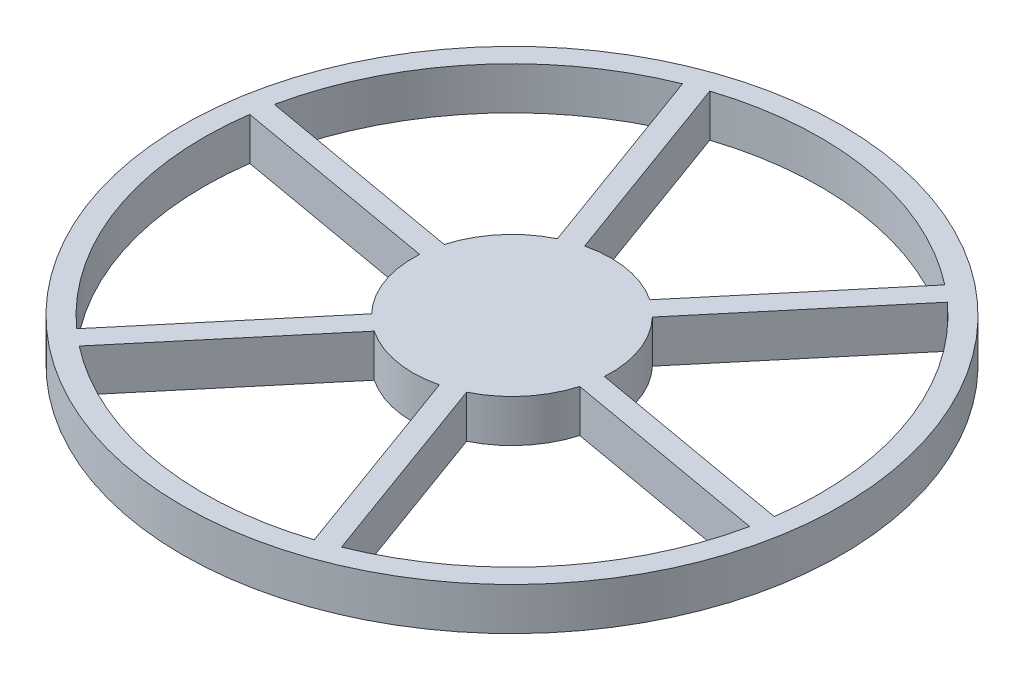
ISO-10303-21;
HEADER;
FILE_DESCRIPTION(('STEP AP214'),'2;1');
FILE_NAME('part.step','',(''),(''),'','','');
FILE_SCHEMA(('AUTOMOTIVE_DESIGN { 1 0 10303 214 1 1 1 1 }'));
ENDSEC;
DATA;
#1=APPLICATION_CONTEXT('core data for automotive mechanical design processes');
#2=APPLICATION_PROTOCOL_DEFINITION('international standard','automotive_design',2000,#1);
#3=PRODUCT_CONTEXT('',#1,'mechanical');
#4=PRODUCT('Part','Part','',(#3));
#5=PRODUCT_RELATED_PRODUCT_CATEGORY('part','',(#4));
#6=PRODUCT_DEFINITION_FORMATION('','',#4);
#7=PRODUCT_DEFINITION_CONTEXT('part definition',#1,'design');
#8=PRODUCT_DEFINITION('design','',#6,#7);
#9=PRODUCT_DEFINITION_SHAPE('','',#8);
#10=(LENGTH_UNIT() NAMED_UNIT(*) SI_UNIT(.MILLI.,.METRE.));
#11=(NAMED_UNIT(*) PLANE_ANGLE_UNIT() SI_UNIT($,.RADIAN.));
#12=(NAMED_UNIT(*) SI_UNIT($,.STERADIAN.) SOLID_ANGLE_UNIT());
#13=UNCERTAINTY_MEASURE_WITH_UNIT(LENGTH_MEASURE(1.E-05),#10,'distance_accuracy_value','');
#14=(GEOMETRIC_REPRESENTATION_CONTEXT(3) GLOBAL_UNCERTAINTY_ASSIGNED_CONTEXT((#13)) GLOBAL_UNIT_ASSIGNED_CONTEXT((#10,
#11,#12)) REPRESENTATION_CONTEXT('',''));
#15=CARTESIAN_POINT('',(0.,0.,0.));
#16=DIRECTION('',(0.,0.,1.));
#17=DIRECTION('',(1.,0.,0.));
#18=AXIS2_PLACEMENT_3D('',#15,#16,#17);
#19=CARTESIAN_POINT('',(0.,12.7,0.));
#20=DIRECTION('',(0.,-1.,0.));
#21=DIRECTION('',(0.,0.,-1.));
#22=AXIS2_PLACEMENT_3D('',#19,#20,#21);
#23=CYLINDRICAL_SURFACE('',#22,98.425);
#24=CARTESIAN_POINT('',(0.,12.7,0.));
#25=DIRECTION('',(0.,1.,0.));
#26=DIRECTION('',(0.,0.,1.));
#27=AXIS2_PLACEMENT_3D('',#24,#25,#26);
#28=CIRCLE('',#27,98.425);
#29=CARTESIAN_POINT('',(0.,12.7,98.425));
#30=VERTEX_POINT('',#29);
#31=EDGE_CURVE('E11',#30,#30,#28,.T.);
#32=ORIENTED_EDGE('',*,*,#31,.F.);
#33=EDGE_LOOP('',(#32));
#34=FACE_BOUND('',#33,.T.);
#35=CARTESIAN_POINT('',(0.,0.,0.));
#36=DIRECTION('',(0.,1.,0.));
#37=DIRECTION('',(0.,0.,1.));
#38=AXIS2_PLACEMENT_3D('',#35,#36,#37);
#39=CIRCLE('',#38,98.425);
#40=CARTESIAN_POINT('',(0.,0.,98.425));
#41=VERTEX_POINT('',#40);
#42=EDGE_CURVE('E36',#41,#41,#39,.T.);
#43=ORIENTED_EDGE('',*,*,#42,.T.);
#44=EDGE_LOOP('',(#43));
#45=FACE_BOUND('',#44,.T.);
#46=ADVANCED_FACE('F33',(#34,#45),#23,.T.);
#47=CARTESIAN_POINT('',(0.,12.7,0.));
#48=DIRECTION('',(0.,1.,0.));
#49=DIRECTION('',(0.,0.,1.));
#50=AXIS2_PLACEMENT_3D('',#47,#48,#49);
#51=PLANE('',#50);
#52=CARTESIAN_POINT('',(0.,12.7,0.));
#53=DIRECTION('',(0.,1.,0.));
#54=DIRECTION('',(0.,0.,1.));
#55=AXIS2_PLACEMENT_3D('',#52,#53,#54);
#56=CIRCLE('',#55,92.075);
#57=CARTESIAN_POINT('',(-34.4563005444042,12.7,-85.3848287331754));
#58=VERTEX_POINT('',#57);
#59=CARTESIAN_POINT('',(-90.0709151247292,12.7,-19.1059120063355));
#60=VERTEX_POINT('',#59);
#61=EDGE_CURVE('E47',#58,#60,#56,.T.);
#62=ORIENTED_EDGE('',*,*,#61,.F.);
#63=DIRECTION('',(-0.342020143325668,0.,-0.939692620785909));
#64=VECTOR('',#63,1.);
#65=CARTESIAN_POINT('',(-13.0671740658742,12.7,-26.6186867115551));
#66=LINE('',#65,#64);
#67=CARTESIAN_POINT('',(-13.0671740658742,12.7,-26.6186867115551));
#68=VERTEX_POINT('',#67);
#69=EDGE_CURVE('E211',#68,#58,#66,.T.);
#70=ORIENTED_EDGE('',*,*,#69,.F.);
#71=CARTESIAN_POINT('',(0.,12.7,0.));
#72=DIRECTION('',(0.,-1.,0.));
#73=DIRECTION('',(0.,0.,1.));
#74=AXIS2_PLACEMENT_3D('',#71,#72,#73);
#75=CIRCLE('',#74,29.6530861853497);
#76=CARTESIAN_POINT('',(-28.4833800123381,12.7,-8.24636789068482));
#77=VERTEX_POINT('',#76);
#78=EDGE_CURVE('E214',#77,#68,#75,.T.);
#79=ORIENTED_EDGE('',*,*,#78,.F.);
#80=DIRECTION('',(0.984807753012191,0.,0.173648177667026));
#81=VECTOR('',#80,1.);
#82=CARTESIAN_POINT('',(-28.4833800123381,12.7,-8.24636789068482));
#83=LINE('',#82,#81);
#84=EDGE_CURVE('E220',#60,#77,#83,.T.);
#85=ORIENTED_EDGE('',*,*,#84,.F.);
#86=EDGE_LOOP('',(#62,#70,#79,#85));
#87=FACE_BOUND('',#86,.T.);
#88=CARTESIAN_POINT('',(0.,12.7,0.));
#89=DIRECTION('',(0.,1.,0.));
#90=DIRECTION('',(0.,0.,1.));
#91=AXIS2_PLACEMENT_3D('',#88,#89,#90);
#92=CIRCLE('',#91,92.0749999999998);
#93=CARTESIAN_POINT('',(-91.1735810529151,12.7,-12.852382774702));
#94=VERTEX_POINT('',#93);
#95=CARTESIAN_POINT('',(-61.5816627223215,12.7,68.4507446369595));
#96=VERTEX_POINT('',#95);
#97=EDGE_CURVE('E226',#94,#96,#92,.T.);
#98=ORIENTED_EDGE('',*,*,#97,.F.);
#99=DIRECTION('',(-0.984807753012208,0.,-0.173648177666931));
#100=VECTOR('',#99,1.);
#101=CARTESIAN_POINT('',(-29.5860459405231,12.7,-1.99283865905731));
#102=LINE('',#101,#100);
#103=CARTESIAN_POINT('',(-29.5860459405231,12.7,-1.99283865905733));
#104=VERTEX_POINT('',#103);
#105=EDGE_CURVE('E234',#104,#94,#102,.T.);
#106=ORIENTED_EDGE('',*,*,#105,.F.);
#107=CARTESIAN_POINT('',(0.,12.7,0.));
#108=DIRECTION('',(0.,-1.,0.));
#109=DIRECTION('',(0.,0.,1.));
#110=AXIS2_PLACEMENT_3D('',#107,#108,#109);
#111=CIRCLE('',#110,29.6530861853497);
#112=CARTESIAN_POINT('',(-21.3832540884544,12.7,20.5441467309883));
#113=VERTEX_POINT('',#112);
#114=EDGE_CURVE('E248',#113,#104,#111,.T.);
#115=ORIENTED_EDGE('',*,*,#114,.F.);
#116=DIRECTION('',(0.642787609686618,0.,-0.766044443118913));
#117=VECTOR('',#116,1.);
#118=CARTESIAN_POINT('',(-21.3832540884544,12.7,20.5441467309883));
#119=LINE('',#118,#117);
#120=EDGE_CURVE('E245',#96,#113,#119,.T.);
#121=ORIENTED_EDGE('',*,*,#120,.F.);
#122=EDGE_LOOP('',(#98,#106,#115,#121));
#123=FACE_BOUND('',#122,.T.);
#124=CARTESIAN_POINT('',(0.,12.7,0.));
#125=DIRECTION('',(0.,1.,0.));
#126=DIRECTION('',(0.,0.,1.));
#127=AXIS2_PLACEMENT_3D('',#124,#125,#126);
#128=CIRCLE('',#127,92.0749999999998);
#129=CARTESIAN_POINT('',(-56.717280508511,12.7,72.532445958473));
#130=VERTEX_POINT('',#129);
#131=CARTESIAN_POINT('',(28.4892524024083,12.7,87.5566566432951));
#132=VERTEX_POINT('',#131);
#133=EDGE_CURVE('E255',#130,#132,#128,.T.);
#134=ORIENTED_EDGE('',*,*,#133,.F.);
#135=DIRECTION('',(-0.642787609686541,0.,0.766044443118977));
#136=VECTOR('',#135,1.);
#137=CARTESIAN_POINT('',(-16.5188718746489,12.7,24.6258480524978));
#138=LINE('',#137,#136);
#139=CARTESIAN_POINT('',(-16.5188718746489,12.7,24.6258480524978));
#140=VERTEX_POINT('',#139);
#141=EDGE_CURVE('E266',#140,#130,#138,.T.);
#142=ORIENTED_EDGE('',*,*,#141,.F.);
#143=CARTESIAN_POINT('',(0.,12.7,0.));
#144=DIRECTION('',(0.,-1.,0.));
#145=DIRECTION('',(0.,0.,1.));
#146=AXIS2_PLACEMENT_3D('',#143,#144,#145);
#147=CIRCLE('',#146,29.6530861853497);
#148=CARTESIAN_POINT('',(7.10012592388372,12.7,28.7905146216731));
#149=VERTEX_POINT('',#148);
#150=EDGE_CURVE('E280',#149,#140,#147,.T.);
#151=ORIENTED_EDGE('',*,*,#150,.F.);
#152=DIRECTION('',(-0.342020143325583,0.,-0.93969262078594));
#153=VECTOR('',#152,1.);
#154=CARTESIAN_POINT('',(7.10012592388372,12.7,28.7905146216731));
#155=LINE('',#154,#153);
#156=EDGE_CURVE('E277',#132,#149,#155,.T.);
#157=ORIENTED_EDGE('',*,*,#156,.F.);
#158=EDGE_LOOP('',(#134,#142,#151,#157));
#159=FACE_BOUND('',#158,.T.);
#160=CARTESIAN_POINT('',(0.,12.7,0.));
#161=DIRECTION('',(0.,1.,0.));
#162=DIRECTION('',(0.,0.,1.));
#163=AXIS2_PLACEMENT_3D('',#160,#161,#162);
#164=CIRCLE('',#163,92.0749999999998);
#165=CARTESIAN_POINT('',(34.456300544404,12.7,85.384828733175));
#166=VERTEX_POINT('',#165);
#167=CARTESIAN_POINT('',(90.0709151247292,12.7,19.1059120063356));
#168=VERTEX_POINT('',#167);
#169=EDGE_CURVE('E287',#166,#168,#164,.T.);
#170=ORIENTED_EDGE('',*,*,#169,.F.);
#171=DIRECTION('',(0.342020143325667,0.,0.939692620785909));
#172=VECTOR('',#171,1.);
#173=CARTESIAN_POINT('',(13.0671740658743,12.7,26.6186867115551));
#174=LINE('',#173,#172);
#175=CARTESIAN_POINT('',(13.0671740658743,12.7,26.6186867115551));
#176=VERTEX_POINT('',#175);
#177=EDGE_CURVE('E298',#176,#166,#174,.T.);
#178=ORIENTED_EDGE('',*,*,#177,.F.);
#179=CARTESIAN_POINT('',(0.,12.7,0.));
#180=DIRECTION('',(0.,-1.,0.));
#181=DIRECTION('',(0.,0.,1.));
#182=AXIS2_PLACEMENT_3D('',#179,#180,#181);
#183=CIRCLE('',#182,29.6530861853497);
#184=CARTESIAN_POINT('',(28.4833800123381,12.7,8.2463678906847));
#185=VERTEX_POINT('',#184);
#186=EDGE_CURVE('E312',#185,#176,#183,.T.);
#187=ORIENTED_EDGE('',*,*,#186,.F.);
#188=DIRECTION('',(-0.984807753012191,0.,-0.173648177667029));
#189=VECTOR('',#188,1.);
#190=CARTESIAN_POINT('',(28.4833800123381,12.7,8.2463678906847));
#191=LINE('',#190,#189);
#192=EDGE_CURVE('E309',#168,#185,#191,.T.);
#193=ORIENTED_EDGE('',*,*,#192,.F.);
#194=EDGE_LOOP('',(#170,#178,#187,#193));
#195=FACE_BOUND('',#194,.T.);
#196=CARTESIAN_POINT('',(0.,12.7,0.));
#197=DIRECTION('',(0.,1.,0.));
#198=DIRECTION('',(0.,0.,1.));
#199=AXIS2_PLACEMENT_3D('',#196,#197,#198);
#200=CIRCLE('',#199,92.075);
#201=CARTESIAN_POINT('',(56.7172805085112,12.7,-72.5324459584734));
#202=VERTEX_POINT('',#201);
#203=CARTESIAN_POINT('',(-28.4892524023576,12.7,-87.5566566433117));
#204=VERTEX_POINT('',#203);
#205=EDGE_CURVE('E319',#202,#204,#200,.T.);
#206=ORIENTED_EDGE('',*,*,#205,.F.);
#207=DIRECTION('',(0.64278760968654,0.,-0.766044443118977));
#208=VECTOR('',#207,1.);
#209=CARTESIAN_POINT('',(16.5188718746488,12.7,-24.6258480524979));
#210=LINE('',#209,#208);
#211=CARTESIAN_POINT('',(16.5188718746488,12.7,-24.6258480524979));
#212=VERTEX_POINT('',#211);
#213=EDGE_CURVE('E330',#212,#202,#210,.T.);
#214=ORIENTED_EDGE('',*,*,#213,.F.);
#215=CARTESIAN_POINT('',(0.,12.7,0.));
#216=DIRECTION('',(0.,-1.,0.));
#217=DIRECTION('',(0.,0.,1.));
#218=AXIS2_PLACEMENT_3D('',#215,#216,#217);
#219=CIRCLE('',#218,29.6530861853497);
#220=CARTESIAN_POINT('',(-7.10012592386938,12.7,-28.7905146216766));
#221=VERTEX_POINT('',#220);
#222=EDGE_CURVE('E344',#221,#212,#219,.T.);
#223=ORIENTED_EDGE('',*,*,#222,.F.);
#224=DIRECTION('',(0.342020143325002,0.,0.939692620786151));
#225=VECTOR('',#224,1.);
#226=CARTESIAN_POINT('',(-7.10012592386939,12.7,-28.7905146216766));
#227=LINE('',#226,#225);
#228=EDGE_CURVE('E341',#204,#221,#227,.T.);
#229=ORIENTED_EDGE('',*,*,#228,.F.);
#230=EDGE_LOOP('',(#206,#214,#223,#229));
#231=FACE_BOUND('',#230,.T.);
#232=CARTESIAN_POINT('',(0.,12.7,0.));
#233=DIRECTION('',(0.,1.,0.));
#234=DIRECTION('',(0.,0.,1.));
#235=AXIS2_PLACEMENT_3D('',#232,#233,#234);
#236=CIRCLE('',#235,92.0749999999998);
#237=CARTESIAN_POINT('',(91.1735810529151,12.7,12.8523827747019));
#238=VERTEX_POINT('',#237);
#239=CARTESIAN_POINT('',(61.5816627223167,12.7,-68.4507446369638));
#240=VERTEX_POINT('',#239);
#241=EDGE_CURVE('E351',#238,#240,#236,.T.);
#242=ORIENTED_EDGE('',*,*,#241,.F.);
#243=DIRECTION('',(0.984807753012208,0.,0.173648177666931));
#244=VECTOR('',#243,1.);
#245=CARTESIAN_POINT('',(29.5860459405231,12.7,1.99283865905718));
#246=LINE('',#245,#244);
#247=CARTESIAN_POINT('',(29.5860459405231,12.7,1.99283865905719));
#248=VERTEX_POINT('',#247);
#249=EDGE_CURVE('E362',#248,#238,#246,.T.);
#250=ORIENTED_EDGE('',*,*,#249,.F.);
#251=CARTESIAN_POINT('',(0.,12.7,0.));
#252=DIRECTION('',(0.,-1.,0.));
#253=DIRECTION('',(0.,0.,1.));
#254=AXIS2_PLACEMENT_3D('',#251,#252,#253);
#255=CIRCLE('',#254,29.6530861853497);
#256=CARTESIAN_POINT('',(21.3832540884543,12.7,-20.5441467309884));
#257=VERTEX_POINT('',#256);
#258=EDGE_CURVE('E376',#257,#248,#255,.T.);
#259=ORIENTED_EDGE('',*,*,#258,.F.);
#260=DIRECTION('',(-0.64278760968654,0.,0.766044443118977));
#261=VECTOR('',#260,1.);
#262=CARTESIAN_POINT('',(21.3832540884543,12.7,-20.5441467309884));
#263=LINE('',#262,#261);
#264=EDGE_CURVE('E373',#240,#257,#263,.T.);
#265=ORIENTED_EDGE('',*,*,#264,.F.);
#266=EDGE_LOOP('',(#242,#250,#259,#265));
#267=FACE_BOUND('',#266,.T.);
#268=ORIENTED_EDGE('',*,*,#31,.T.);
#269=EDGE_LOOP('',(#268));
#270=FACE_BOUND('',#269,.T.);
#271=ADVANCED_FACE('F398',(#87,#123,#159,#195,#231,#267,#270),#51,.T.);
#272=CARTESIAN_POINT('',(0.,0.,0.));
#273=DIRECTION('',(0.,1.,0.));
#274=DIRECTION('',(0.,0.,1.));
#275=AXIS2_PLACEMENT_3D('',#272,#273,#274);
#276=PLANE('',#275);
#277=DIRECTION('',(-0.342020143325668,0.,-0.939692620785909));
#278=VECTOR('',#277,1.);
#279=CARTESIAN_POINT('',(-13.0671740658742,0.,-26.6186867115551));
#280=LINE('',#279,#278);
#281=CARTESIAN_POINT('',(-13.0671740658742,0.,-26.6186867115551));
#282=VERTEX_POINT('',#281);
#283=CARTESIAN_POINT('',(-34.4563005444042,0.,-85.3848287331754));
#284=VERTEX_POINT('',#283);
#285=EDGE_CURVE('E201',#282,#284,#280,.T.);
#286=ORIENTED_EDGE('',*,*,#285,.T.);
#287=CARTESIAN_POINT('',(0.,0.,0.));
#288=DIRECTION('',(0.,1.,0.));
#289=DIRECTION('',(0.,0.,1.));
#290=AXIS2_PLACEMENT_3D('',#287,#288,#289);
#291=CIRCLE('',#290,92.075);
#292=CARTESIAN_POINT('',(-90.0709151247292,0.,-19.1059120063355));
#293=VERTEX_POINT('',#292);
#294=EDGE_CURVE('E195',#284,#293,#291,.T.);
#295=ORIENTED_EDGE('',*,*,#294,.T.);
#296=DIRECTION('',(0.984807753012191,0.,0.173648177667026));
#297=VECTOR('',#296,1.);
#298=CARTESIAN_POINT('',(-28.4833800123381,0.,-8.24636789068482));
#299=LINE('',#298,#297);
#300=CARTESIAN_POINT('',(-28.4833800123381,0.,-8.24636789068482));
#301=VERTEX_POINT('',#300);
#302=EDGE_CURVE('E204',#293,#301,#299,.T.);
#303=ORIENTED_EDGE('',*,*,#302,.T.);
#304=CARTESIAN_POINT('',(0.,0.,0.));
#305=DIRECTION('',(0.,-1.,0.));
#306=DIRECTION('',(0.,0.,1.));
#307=AXIS2_PLACEMENT_3D('',#304,#305,#306);
#308=CIRCLE('',#307,29.6530861853497);
#309=EDGE_CURVE('E55',#301,#282,#308,.T.);
#310=ORIENTED_EDGE('',*,*,#309,.T.);
#311=EDGE_LOOP('',(#286,#295,#303,#310));
#312=FACE_BOUND('',#311,.T.);
#313=DIRECTION('',(-0.984807753012208,0.,-0.173648177666931));
#314=VECTOR('',#313,1.);
#315=CARTESIAN_POINT('',(-29.5860459405231,0.,-1.99283865905731));
#316=LINE('',#315,#314);
#317=CARTESIAN_POINT('',(-29.5860459405231,0.,-1.99283865905733));
#318=VERTEX_POINT('',#317);
#319=CARTESIAN_POINT('',(-91.1735810529151,0.,-12.852382774702));
#320=VERTEX_POINT('',#319);
#321=EDGE_CURVE('E240',#318,#320,#316,.T.);
#322=ORIENTED_EDGE('',*,*,#321,.T.);
#323=CARTESIAN_POINT('',(0.,0.,0.));
#324=DIRECTION('',(0.,1.,0.));
#325=DIRECTION('',(0.,0.,1.));
#326=AXIS2_PLACEMENT_3D('',#323,#324,#325);
#327=CIRCLE('',#326,92.0749999999998);
#328=CARTESIAN_POINT('',(-61.5816627223215,0.,68.4507446369595));
#329=VERTEX_POINT('',#328);
#330=EDGE_CURVE('E230',#320,#329,#327,.T.);
#331=ORIENTED_EDGE('',*,*,#330,.T.);
#332=DIRECTION('',(0.642787609686618,0.,-0.766044443118913));
#333=VECTOR('',#332,1.);
#334=CARTESIAN_POINT('',(-21.3832540884544,0.,20.5441467309883));
#335=LINE('',#334,#333);
#336=CARTESIAN_POINT('',(-21.3832540884544,0.,20.5441467309883));
#337=VERTEX_POINT('',#336);
#338=EDGE_CURVE('E233',#329,#337,#335,.T.);
#339=ORIENTED_EDGE('',*,*,#338,.T.);
#340=CARTESIAN_POINT('',(0.,0.,0.));
#341=DIRECTION('',(0.,-1.,0.));
#342=DIRECTION('',(0.,0.,1.));
#343=AXIS2_PLACEMENT_3D('',#340,#341,#342);
#344=CIRCLE('',#343,29.6530861853497);
#345=EDGE_CURVE('E237',#337,#318,#344,.T.);
#346=ORIENTED_EDGE('',*,*,#345,.T.);
#347=EDGE_LOOP('',(#322,#331,#339,#346));
#348=FACE_BOUND('',#347,.T.);
#349=DIRECTION('',(-0.642787609686541,0.,0.766044443118977));
#350=VECTOR('',#349,1.);
#351=CARTESIAN_POINT('',(-16.5188718746489,0.,24.6258480524978));
#352=LINE('',#351,#350);
#353=CARTESIAN_POINT('',(-16.5188718746489,0.,24.6258480524978));
#354=VERTEX_POINT('',#353);
#355=CARTESIAN_POINT('',(-56.717280508511,0.,72.532445958473));
#356=VERTEX_POINT('',#355);
#357=EDGE_CURVE('E272',#354,#356,#352,.T.);
#358=ORIENTED_EDGE('',*,*,#357,.T.);
#359=CARTESIAN_POINT('',(0.,0.,0.));
#360=DIRECTION('',(0.,1.,0.));
#361=DIRECTION('',(0.,0.,1.));
#362=AXIS2_PLACEMENT_3D('',#359,#360,#361);
#363=CIRCLE('',#362,92.0749999999998);
#364=CARTESIAN_POINT('',(28.4892524024083,0.,87.5566566432951));
#365=VERTEX_POINT('',#364);
#366=EDGE_CURVE('E262',#356,#365,#363,.T.);
#367=ORIENTED_EDGE('',*,*,#366,.T.);
#368=DIRECTION('',(-0.342020143325583,0.,-0.93969262078594));
#369=VECTOR('',#368,1.);
#370=CARTESIAN_POINT('',(7.10012592388372,0.,28.7905146216731));
#371=LINE('',#370,#369);
#372=CARTESIAN_POINT('',(7.10012592388372,0.,28.7905146216731));
#373=VERTEX_POINT('',#372);
#374=EDGE_CURVE('E265',#365,#373,#371,.T.);
#375=ORIENTED_EDGE('',*,*,#374,.T.);
#376=CARTESIAN_POINT('',(0.,0.,0.));
#377=DIRECTION('',(0.,-1.,0.));
#378=DIRECTION('',(0.,0.,1.));
#379=AXIS2_PLACEMENT_3D('',#376,#377,#378);
#380=CIRCLE('',#379,29.6530861853497);
#381=EDGE_CURVE('E269',#373,#354,#380,.T.);
#382=ORIENTED_EDGE('',*,*,#381,.T.);
#383=EDGE_LOOP('',(#358,#367,#375,#382));
#384=FACE_BOUND('',#383,.T.);
#385=DIRECTION('',(0.342020143325667,0.,0.939692620785909));
#386=VECTOR('',#385,1.);
#387=CARTESIAN_POINT('',(13.0671740658743,0.,26.6186867115551));
#388=LINE('',#387,#386);
#389=CARTESIAN_POINT('',(13.0671740658743,0.,26.6186867115551));
#390=VERTEX_POINT('',#389);
#391=CARTESIAN_POINT('',(34.456300544404,0.,85.384828733175));
#392=VERTEX_POINT('',#391);
#393=EDGE_CURVE('E304',#390,#392,#388,.T.);
#394=ORIENTED_EDGE('',*,*,#393,.T.);
#395=CARTESIAN_POINT('',(0.,0.,0.));
#396=DIRECTION('',(0.,1.,0.));
#397=DIRECTION('',(0.,0.,1.));
#398=AXIS2_PLACEMENT_3D('',#395,#396,#397);
#399=CIRCLE('',#398,92.0749999999998);
#400=CARTESIAN_POINT('',(90.0709151247292,0.,19.1059120063356));
#401=VERTEX_POINT('',#400);
#402=EDGE_CURVE('E294',#392,#401,#399,.T.);
#403=ORIENTED_EDGE('',*,*,#402,.T.);
#404=DIRECTION('',(-0.984807753012191,0.,-0.173648177667029));
#405=VECTOR('',#404,1.);
#406=CARTESIAN_POINT('',(28.4833800123381,0.,8.2463678906847));
#407=LINE('',#406,#405);
#408=CARTESIAN_POINT('',(28.4833800123381,0.,8.2463678906847));
#409=VERTEX_POINT('',#408);
#410=EDGE_CURVE('E297',#401,#409,#407,.T.);
#411=ORIENTED_EDGE('',*,*,#410,.T.);
#412=CARTESIAN_POINT('',(0.,0.,0.));
#413=DIRECTION('',(0.,-1.,0.));
#414=DIRECTION('',(0.,0.,1.));
#415=AXIS2_PLACEMENT_3D('',#412,#413,#414);
#416=CIRCLE('',#415,29.6530861853497);
#417=EDGE_CURVE('E301',#409,#390,#416,.T.);
#418=ORIENTED_EDGE('',*,*,#417,.T.);
#419=EDGE_LOOP('',(#394,#403,#411,#418));
#420=FACE_BOUND('',#419,.T.);
#421=DIRECTION('',(0.64278760968654,0.,-0.766044443118977));
#422=VECTOR('',#421,1.);
#423=CARTESIAN_POINT('',(16.5188718746488,0.,-24.6258480524979));
#424=LINE('',#423,#422);
#425=CARTESIAN_POINT('',(16.5188718746488,0.,-24.6258480524979));
#426=VERTEX_POINT('',#425);
#427=CARTESIAN_POINT('',(56.7172805085112,0.,-72.5324459584734));
#428=VERTEX_POINT('',#427);
#429=EDGE_CURVE('E336',#426,#428,#424,.T.);
#430=ORIENTED_EDGE('',*,*,#429,.T.);
#431=CARTESIAN_POINT('',(0.,0.,0.));
#432=DIRECTION('',(0.,1.,0.));
#433=DIRECTION('',(0.,0.,1.));
#434=AXIS2_PLACEMENT_3D('',#431,#432,#433);
#435=CIRCLE('',#434,92.075);
#436=CARTESIAN_POINT('',(-28.4892524023576,0.,-87.5566566433117));
#437=VERTEX_POINT('',#436);
#438=EDGE_CURVE('E326',#428,#437,#435,.T.);
#439=ORIENTED_EDGE('',*,*,#438,.T.);
#440=DIRECTION('',(0.342020143325002,0.,0.939692620786151));
#441=VECTOR('',#440,1.);
#442=CARTESIAN_POINT('',(-7.10012592386939,0.,-28.7905146216766));
#443=LINE('',#442,#441);
#444=CARTESIAN_POINT('',(-7.10012592386939,0.,-28.7905146216766));
#445=VERTEX_POINT('',#444);
#446=EDGE_CURVE('E329',#437,#445,#443,.T.);
#447=ORIENTED_EDGE('',*,*,#446,.T.);
#448=CARTESIAN_POINT('',(0.,0.,0.));
#449=DIRECTION('',(0.,-1.,0.));
#450=DIRECTION('',(0.,0.,1.));
#451=AXIS2_PLACEMENT_3D('',#448,#449,#450);
#452=CIRCLE('',#451,29.6530861853497);
#453=EDGE_CURVE('E333',#445,#426,#452,.T.);
#454=ORIENTED_EDGE('',*,*,#453,.T.);
#455=EDGE_LOOP('',(#430,#439,#447,#454));
#456=FACE_BOUND('',#455,.T.);
#457=DIRECTION('',(0.984807753012208,0.,0.173648177666931));
#458=VECTOR('',#457,1.);
#459=CARTESIAN_POINT('',(29.5860459405231,0.,1.99283865905718));
#460=LINE('',#459,#458);
#461=CARTESIAN_POINT('',(29.5860459405231,0.,1.99283865905719));
#462=VERTEX_POINT('',#461);
#463=CARTESIAN_POINT('',(91.1735810529151,0.,12.8523827747019));
#464=VERTEX_POINT('',#463);
#465=EDGE_CURVE('E368',#462,#464,#460,.T.);
#466=ORIENTED_EDGE('',*,*,#465,.T.);
#467=CARTESIAN_POINT('',(0.,0.,0.));
#468=DIRECTION('',(0.,1.,0.));
#469=DIRECTION('',(0.,0.,1.));
#470=AXIS2_PLACEMENT_3D('',#467,#468,#469);
#471=CIRCLE('',#470,92.0749999999998);
#472=CARTESIAN_POINT('',(61.5816627223167,0.,-68.4507446369638));
#473=VERTEX_POINT('',#472);
#474=EDGE_CURVE('E358',#464,#473,#471,.T.);
#475=ORIENTED_EDGE('',*,*,#474,.T.);
#476=DIRECTION('',(-0.64278760968654,0.,0.766044443118977));
#477=VECTOR('',#476,1.);
#478=CARTESIAN_POINT('',(21.3832540884543,0.,-20.5441467309884));
#479=LINE('',#478,#477);
#480=CARTESIAN_POINT('',(21.3832540884543,0.,-20.5441467309884));
#481=VERTEX_POINT('',#480);
#482=EDGE_CURVE('E361',#473,#481,#479,.T.);
#483=ORIENTED_EDGE('',*,*,#482,.T.);
#484=CARTESIAN_POINT('',(0.,0.,0.));
#485=DIRECTION('',(0.,-1.,0.));
#486=DIRECTION('',(0.,0.,1.));
#487=AXIS2_PLACEMENT_3D('',#484,#485,#486);
#488=CIRCLE('',#487,29.6530861853497);
#489=EDGE_CURVE('E365',#481,#462,#488,.T.);
#490=ORIENTED_EDGE('',*,*,#489,.T.);
#491=EDGE_LOOP('',(#466,#475,#483,#490));
#492=FACE_BOUND('',#491,.T.);
#493=ORIENTED_EDGE('',*,*,#42,.F.);
#494=EDGE_LOOP('',(#493));
#495=FACE_BOUND('',#494,.T.);
#496=ADVANCED_FACE('F208',(#312,#348,#384,#420,#456,#492,#495),#276,.F.);
#497=CARTESIAN_POINT('',(0.,0.,0.));
#498=DIRECTION('',(0.,1.,0.));
#499=DIRECTION('',(0.,0.,1.));
#500=AXIS2_PLACEMENT_3D('',#497,#498,#499);
#501=CYLINDRICAL_SURFACE('',#500,92.0749999999998);
#502=ORIENTED_EDGE('',*,*,#241,.T.);
#503=DIRECTION('',(0.,1.,0.));
#504=VECTOR('',#503,1.);
#505=CARTESIAN_POINT('',(61.5816627223167,0.,-68.4507446369638));
#506=LINE('',#505,#504);
#507=EDGE_CURVE('E371',#473,#240,#506,.T.);
#508=ORIENTED_EDGE('',*,*,#507,.F.);
#509=ORIENTED_EDGE('',*,*,#474,.F.);
#510=DIRECTION('',(0.,1.,0.));
#511=VECTOR('',#510,1.);
#512=CARTESIAN_POINT('',(91.1735810529151,0.,12.8523827747019));
#513=LINE('',#512,#511);
#514=EDGE_CURVE('E381',#464,#238,#513,.T.);
#515=ORIENTED_EDGE('',*,*,#514,.T.);
#516=EDGE_LOOP('',(#502,#508,#509,#515));
#517=FACE_BOUND('',#516,.T.);
#518=ADVANCED_FACE('F406',(#517),#501,.F.);
#519=CARTESIAN_POINT('',(29.5860459405231,0.,1.99283865905718));
#520=DIRECTION('',(-0.173648177666931,0.,0.984807753012208));
#521=DIRECTION('',(0.984807753012208,0.,0.173648177666931));
#522=AXIS2_PLACEMENT_3D('',#519,#520,#521);
#523=PLANE('',#522);
#524=ORIENTED_EDGE('',*,*,#249,.T.);
#525=ORIENTED_EDGE('',*,*,#514,.F.);
#526=ORIENTED_EDGE('',*,*,#465,.F.);
#527=DIRECTION('',(0.,1.,0.));
#528=VECTOR('',#527,1.);
#529=CARTESIAN_POINT('',(29.5860459405231,0.,1.99283865905719));
#530=LINE('',#529,#528);
#531=EDGE_CURVE('E383',#462,#248,#530,.T.);
#532=ORIENTED_EDGE('',*,*,#531,.T.);
#533=EDGE_LOOP('',(#524,#525,#526,#532));
#534=FACE_BOUND('',#533,.T.);
#535=ADVANCED_FACE('F408',(#534),#523,.F.);
#536=CARTESIAN_POINT('',(0.,0.,0.));
#537=DIRECTION('',(0.,1.,0.));
#538=DIRECTION('',(0.,0.,1.));
#539=AXIS2_PLACEMENT_3D('',#536,#537,#538);
#540=CYLINDRICAL_SURFACE('',#539,29.6530861853497);
#541=ORIENTED_EDGE('',*,*,#258,.T.);
#542=ORIENTED_EDGE('',*,*,#531,.F.);
#543=ORIENTED_EDGE('',*,*,#489,.F.);
#544=DIRECTION('',(0.,1.,0.));
#545=VECTOR('',#544,1.);
#546=CARTESIAN_POINT('',(21.3832540884543,0.,-20.5441467309884));
#547=LINE('',#546,#545);
#548=EDGE_CURVE('E385',#481,#257,#547,.T.);
#549=ORIENTED_EDGE('',*,*,#548,.T.);
#550=EDGE_LOOP('',(#541,#542,#543,#549));
#551=FACE_BOUND('',#550,.T.);
#552=ADVANCED_FACE('F402',(#551),#540,.T.);
#553=CARTESIAN_POINT('',(21.3832540884543,0.,-20.5441467309884));
#554=DIRECTION('',(-0.766044443118977,0.,-0.64278760968654));
#555=DIRECTION('',(-0.64278760968654,0.,0.766044443118977));
#556=AXIS2_PLACEMENT_3D('',#553,#554,#555);
#557=PLANE('',#556);
#558=ORIENTED_EDGE('',*,*,#264,.T.);
#559=ORIENTED_EDGE('',*,*,#548,.F.);
#560=ORIENTED_EDGE('',*,*,#482,.F.);
#561=ORIENTED_EDGE('',*,*,#507,.T.);
#562=EDGE_LOOP('',(#558,#559,#560,#561));
#563=FACE_BOUND('',#562,.T.);
#564=ADVANCED_FACE('F391',(#563),#557,.F.);
#565=CARTESIAN_POINT('',(0.,0.,0.));
#566=DIRECTION('',(0.,1.,0.));
#567=DIRECTION('',(0.,0.,1.));
#568=AXIS2_PLACEMENT_3D('',#565,#566,#567);
#569=CYLINDRICAL_SURFACE('',#568,92.075);
#570=ORIENTED_EDGE('',*,*,#205,.T.);
#571=DIRECTION('',(0.,1.,0.));
#572=VECTOR('',#571,1.);
#573=CARTESIAN_POINT('',(-28.4892524023576,0.,-87.5566566433117));
#574=LINE('',#573,#572);
#575=EDGE_CURVE('E339',#437,#204,#574,.T.);
#576=ORIENTED_EDGE('',*,*,#575,.F.);
#577=ORIENTED_EDGE('',*,*,#438,.F.);
#578=DIRECTION('',(0.,1.,0.));
#579=VECTOR('',#578,1.);
#580=CARTESIAN_POINT('',(56.7172805085112,0.,-72.5324459584734));
#581=LINE('',#580,#579);
#582=EDGE_CURVE('E349',#428,#202,#581,.T.);
#583=ORIENTED_EDGE('',*,*,#582,.T.);
#584=EDGE_LOOP('',(#570,#576,#577,#583));
#585=FACE_BOUND('',#584,.T.);
#586=ADVANCED_FACE('F434',(#585),#569,.F.);
#587=CARTESIAN_POINT('',(16.5188718746488,0.,-24.6258480524979));
#588=DIRECTION('',(0.766044443118977,0.,0.64278760968654));
#589=DIRECTION('',(0.64278760968654,0.,-0.766044443118977));
#590=AXIS2_PLACEMENT_3D('',#587,#588,#589);
#591=PLANE('',#590);
#592=ORIENTED_EDGE('',*,*,#213,.T.);
#593=ORIENTED_EDGE('',*,*,#582,.F.);
#594=ORIENTED_EDGE('',*,*,#429,.F.);
#595=DIRECTION('',(0.,1.,0.));
#596=VECTOR('',#595,1.);
#597=CARTESIAN_POINT('',(16.5188718746488,0.,-24.6258480524979));
#598=LINE('',#597,#596);
#599=EDGE_CURVE('E352',#426,#212,#598,.T.);
#600=ORIENTED_EDGE('',*,*,#599,.T.);
#601=EDGE_LOOP('',(#592,#593,#594,#600));
#602=FACE_BOUND('',#601,.T.);
#603=ADVANCED_FACE('F438',(#602),#591,.F.);
#604=CARTESIAN_POINT('',(0.,0.,0.));
#605=DIRECTION('',(0.,1.,0.));
#606=DIRECTION('',(0.,0.,1.));
#607=AXIS2_PLACEMENT_3D('',#604,#605,#606);
#608=CYLINDRICAL_SURFACE('',#607,29.6530861853497);
#609=ORIENTED_EDGE('',*,*,#222,.T.);
#610=ORIENTED_EDGE('',*,*,#599,.F.);
#611=ORIENTED_EDGE('',*,*,#453,.F.);
#612=DIRECTION('',(0.,1.,0.));
#613=VECTOR('',#612,1.);
#614=CARTESIAN_POINT('',(-7.10012592386938,0.,-28.7905146216766));
#615=LINE('',#614,#613);
#616=EDGE_CURVE('E354',#445,#221,#615,.T.);
#617=ORIENTED_EDGE('',*,*,#616,.T.);
#618=EDGE_LOOP('',(#609,#610,#611,#617));
#619=FACE_BOUND('',#618,.T.);
#620=ADVANCED_FACE('F443',(#619),#608,.T.);
#621=CARTESIAN_POINT('',(-7.10012592386939,0.,-28.7905146216766));
#622=DIRECTION('',(-0.939692620786151,0.,0.342020143325002));
#623=DIRECTION('',(0.342020143325002,0.,0.939692620786151));
#624=AXIS2_PLACEMENT_3D('',#621,#622,#623);
#625=PLANE('',#624);
#626=ORIENTED_EDGE('',*,*,#228,.T.);
#627=ORIENTED_EDGE('',*,*,#616,.F.);
#628=ORIENTED_EDGE('',*,*,#446,.F.);
#629=ORIENTED_EDGE('',*,*,#575,.T.);
#630=EDGE_LOOP('',(#626,#627,#628,#629));
#631=FACE_BOUND('',#630,.T.);
#632=ADVANCED_FACE('F447',(#631),#625,.F.);
#633=CARTESIAN_POINT('',(0.,0.,0.));
#634=DIRECTION('',(0.,1.,0.));
#635=DIRECTION('',(0.,0.,1.));
#636=AXIS2_PLACEMENT_3D('',#633,#634,#635);
#637=CYLINDRICAL_SURFACE('',#636,92.0749999999998);
#638=ORIENTED_EDGE('',*,*,#169,.T.);
#639=DIRECTION('',(0.,1.,0.));
#640=VECTOR('',#639,1.);
#641=CARTESIAN_POINT('',(90.0709151247292,0.,19.1059120063356));
#642=LINE('',#641,#640);
#643=EDGE_CURVE('E307',#401,#168,#642,.T.);
#644=ORIENTED_EDGE('',*,*,#643,.F.);
#645=ORIENTED_EDGE('',*,*,#402,.F.);
#646=DIRECTION('',(0.,1.,0.));
#647=VECTOR('',#646,1.);
#648=CARTESIAN_POINT('',(34.456300544404,0.,85.384828733175));
#649=LINE('',#648,#647);
#650=EDGE_CURVE('E317',#392,#166,#649,.T.);
#651=ORIENTED_EDGE('',*,*,#650,.T.);
#652=EDGE_LOOP('',(#638,#644,#645,#651));
#653=FACE_BOUND('',#652,.T.);
#654=ADVANCED_FACE('F450',(#653),#637,.F.);
#655=CARTESIAN_POINT('',(13.0671740658743,0.,26.6186867115551));
#656=DIRECTION('',(-0.939692620785909,0.,0.342020143325667));
#657=DIRECTION('',(0.342020143325667,0.,0.939692620785909));
#658=AXIS2_PLACEMENT_3D('',#655,#656,#657);
#659=PLANE('',#658);
#660=ORIENTED_EDGE('',*,*,#177,.T.);
#661=ORIENTED_EDGE('',*,*,#650,.F.);
#662=ORIENTED_EDGE('',*,*,#393,.F.);
#663=DIRECTION('',(0.,1.,0.));
#664=VECTOR('',#663,1.);
#665=CARTESIAN_POINT('',(13.0671740658743,0.,26.6186867115551));
#666=LINE('',#665,#664);
#667=EDGE_CURVE('E320',#390,#176,#666,.T.);
#668=ORIENTED_EDGE('',*,*,#667,.T.);
#669=EDGE_LOOP('',(#660,#661,#662,#668));
#670=FACE_BOUND('',#669,.T.);
#671=ADVANCED_FACE('F457',(#670),#659,.F.);
#672=CARTESIAN_POINT('',(0.,0.,0.));
#673=DIRECTION('',(0.,1.,0.));
#674=DIRECTION('',(0.,0.,1.));
#675=AXIS2_PLACEMENT_3D('',#672,#673,#674);
#676=CYLINDRICAL_SURFACE('',#675,29.6530861853497);
#677=ORIENTED_EDGE('',*,*,#186,.T.);
#678=ORIENTED_EDGE('',*,*,#667,.F.);
#679=ORIENTED_EDGE('',*,*,#417,.F.);
#680=DIRECTION('',(0.,1.,0.));
#681=VECTOR('',#680,1.);
#682=CARTESIAN_POINT('',(28.4833800123381,0.,8.2463678906847));
#683=LINE('',#682,#681);
#684=EDGE_CURVE('E322',#409,#185,#683,.T.);
#685=ORIENTED_EDGE('',*,*,#684,.T.);
#686=EDGE_LOOP('',(#677,#678,#679,#685));
#687=FACE_BOUND('',#686,.T.);
#688=ADVANCED_FACE('F463',(#687),#676,.T.);
#689=CARTESIAN_POINT('',(28.4833800123381,0.,8.2463678906847));
#690=DIRECTION('',(0.173648177667029,0.,-0.98480775301219));
#691=DIRECTION('',(-0.984807753012191,0.,-0.173648177667029));
#692=AXIS2_PLACEMENT_3D('',#689,#690,#691);
#693=PLANE('',#692);
#694=ORIENTED_EDGE('',*,*,#192,.T.);
#695=ORIENTED_EDGE('',*,*,#684,.F.);
#696=ORIENTED_EDGE('',*,*,#410,.F.);
#697=ORIENTED_EDGE('',*,*,#643,.T.);
#698=EDGE_LOOP('',(#694,#695,#696,#697));
#699=FACE_BOUND('',#698,.T.);
#700=ADVANCED_FACE('F459',(#699),#693,.F.);
#701=CARTESIAN_POINT('',(0.,0.,0.));
#702=DIRECTION('',(0.,1.,0.));
#703=DIRECTION('',(0.,0.,1.));
#704=AXIS2_PLACEMENT_3D('',#701,#702,#703);
#705=CYLINDRICAL_SURFACE('',#704,92.0749999999998);
#706=ORIENTED_EDGE('',*,*,#133,.T.);
#707=DIRECTION('',(0.,1.,0.));
#708=VECTOR('',#707,1.);
#709=CARTESIAN_POINT('',(28.4892524024083,0.,87.5566566432951));
#710=LINE('',#709,#708);
#711=EDGE_CURVE('E275',#365,#132,#710,.T.);
#712=ORIENTED_EDGE('',*,*,#711,.F.);
#713=ORIENTED_EDGE('',*,*,#366,.F.);
#714=DIRECTION('',(0.,1.,0.));
#715=VECTOR('',#714,1.);
#716=CARTESIAN_POINT('',(-56.717280508511,0.,72.532445958473));
#717=LINE('',#716,#715);
#718=EDGE_CURVE('E285',#356,#130,#717,.T.);
#719=ORIENTED_EDGE('',*,*,#718,.T.);
#720=EDGE_LOOP('',(#706,#712,#713,#719));
#721=FACE_BOUND('',#720,.T.);
#722=ADVANCED_FACE('F462',(#721),#705,.F.);
#723=CARTESIAN_POINT('',(-16.5188718746489,0.,24.6258480524978));
#724=DIRECTION('',(-0.766044443118977,0.,-0.64278760968654));
#725=DIRECTION('',(-0.642787609686541,0.,0.766044443118977));
#726=AXIS2_PLACEMENT_3D('',#723,#724,#725);
#727=PLANE('',#726);
#728=ORIENTED_EDGE('',*,*,#141,.T.);
#729=ORIENTED_EDGE('',*,*,#718,.F.);
#730=ORIENTED_EDGE('',*,*,#357,.F.);
#731=DIRECTION('',(0.,1.,0.));
#732=VECTOR('',#731,1.);
#733=CARTESIAN_POINT('',(-16.5188718746489,0.,24.6258480524978));
#734=LINE('',#733,#732);
#735=EDGE_CURVE('E288',#354,#140,#734,.T.);
#736=ORIENTED_EDGE('',*,*,#735,.T.);
#737=EDGE_LOOP('',(#728,#729,#730,#736));
#738=FACE_BOUND('',#737,.T.);
#739=ADVANCED_FACE('F473',(#738),#727,.F.);
#740=CARTESIAN_POINT('',(0.,0.,0.));
#741=DIRECTION('',(0.,1.,0.));
#742=DIRECTION('',(0.,0.,1.));
#743=AXIS2_PLACEMENT_3D('',#740,#741,#742);
#744=CYLINDRICAL_SURFACE('',#743,29.6530861853497);
#745=ORIENTED_EDGE('',*,*,#150,.T.);
#746=ORIENTED_EDGE('',*,*,#735,.F.);
#747=ORIENTED_EDGE('',*,*,#381,.F.);
#748=DIRECTION('',(0.,1.,0.));
#749=VECTOR('',#748,1.);
#750=CARTESIAN_POINT('',(7.10012592388372,0.,28.7905146216731));
#751=LINE('',#750,#749);
#752=EDGE_CURVE('E290',#373,#149,#751,.T.);
#753=ORIENTED_EDGE('',*,*,#752,.T.);
#754=EDGE_LOOP('',(#745,#746,#747,#753));
#755=FACE_BOUND('',#754,.T.);
#756=ADVANCED_FACE('F479',(#755),#744,.T.);
#757=CARTESIAN_POINT('',(7.10012592388372,0.,28.7905146216731));
#758=DIRECTION('',(0.93969262078594,0.,-0.342020143325583));
#759=DIRECTION('',(-0.342020143325583,0.,-0.93969262078594));
#760=AXIS2_PLACEMENT_3D('',#757,#758,#759);
#761=PLANE('',#760);
#762=ORIENTED_EDGE('',*,*,#156,.T.);
#763=ORIENTED_EDGE('',*,*,#752,.F.);
#764=ORIENTED_EDGE('',*,*,#374,.F.);
#765=ORIENTED_EDGE('',*,*,#711,.T.);
#766=EDGE_LOOP('',(#762,#763,#764,#765));
#767=FACE_BOUND('',#766,.T.);
#768=ADVANCED_FACE('F475',(#767),#761,.F.);
#769=CARTESIAN_POINT('',(0.,0.,0.));
#770=DIRECTION('',(0.,1.,0.));
#771=DIRECTION('',(0.,0.,1.));
#772=AXIS2_PLACEMENT_3D('',#769,#770,#771);
#773=CYLINDRICAL_SURFACE('',#772,92.0749999999998);
#774=ORIENTED_EDGE('',*,*,#97,.T.);
#775=DIRECTION('',(0.,1.,0.));
#776=VECTOR('',#775,1.);
#777=CARTESIAN_POINT('',(-61.5816627223215,0.,68.4507446369595));
#778=LINE('',#777,#776);
#779=EDGE_CURVE('E243',#329,#96,#778,.T.);
#780=ORIENTED_EDGE('',*,*,#779,.F.);
#781=ORIENTED_EDGE('',*,*,#330,.F.);
#782=DIRECTION('',(0.,1.,0.));
#783=VECTOR('',#782,1.);
#784=CARTESIAN_POINT('',(-91.1735810529151,0.,-12.852382774702));
#785=LINE('',#784,#783);
#786=EDGE_CURVE('E253',#320,#94,#785,.T.);
#787=ORIENTED_EDGE('',*,*,#786,.T.);
#788=EDGE_LOOP('',(#774,#780,#781,#787));
#789=FACE_BOUND('',#788,.T.);
#790=ADVANCED_FACE('F478',(#789),#773,.F.);
#791=CARTESIAN_POINT('',(-29.5860459405231,0.,-1.99283865905731));
#792=DIRECTION('',(0.173648177666931,0.,-0.984807753012208));
#793=DIRECTION('',(-0.984807753012208,0.,-0.173648177666931));
#794=AXIS2_PLACEMENT_3D('',#791,#792,#793);
#795=PLANE('',#794);
#796=ORIENTED_EDGE('',*,*,#105,.T.);
#797=ORIENTED_EDGE('',*,*,#786,.F.);
#798=ORIENTED_EDGE('',*,*,#321,.F.);
#799=DIRECTION('',(0.,1.,0.));
#800=VECTOR('',#799,1.);
#801=CARTESIAN_POINT('',(-29.5860459405231,0.,-1.99283865905733));
#802=LINE('',#801,#800);
#803=EDGE_CURVE('E256',#318,#104,#802,.T.);
#804=ORIENTED_EDGE('',*,*,#803,.T.);
#805=EDGE_LOOP('',(#796,#797,#798,#804));
#806=FACE_BOUND('',#805,.T.);
#807=ADVANCED_FACE('F489',(#806),#795,.F.);
#808=CARTESIAN_POINT('',(0.,0.,0.));
#809=DIRECTION('',(0.,1.,0.));
#810=DIRECTION('',(0.,0.,1.));
#811=AXIS2_PLACEMENT_3D('',#808,#809,#810);
#812=CYLINDRICAL_SURFACE('',#811,29.6530861853497);
#813=ORIENTED_EDGE('',*,*,#114,.T.);
#814=ORIENTED_EDGE('',*,*,#803,.F.);
#815=ORIENTED_EDGE('',*,*,#345,.F.);
#816=DIRECTION('',(0.,1.,0.));
#817=VECTOR('',#816,1.);
#818=CARTESIAN_POINT('',(-21.3832540884544,0.,20.5441467309883));
#819=LINE('',#818,#817);
#820=EDGE_CURVE('E258',#337,#113,#819,.T.);
#821=ORIENTED_EDGE('',*,*,#820,.T.);
#822=EDGE_LOOP('',(#813,#814,#815,#821));
#823=FACE_BOUND('',#822,.T.);
#824=ADVANCED_FACE('F494',(#823),#812,.T.);
#825=CARTESIAN_POINT('',(-21.3832540884544,0.,20.5441467309883));
#826=DIRECTION('',(0.766044443118912,0.,0.642787609686618));
#827=DIRECTION('',(0.642787609686618,0.,-0.766044443118913));
#828=AXIS2_PLACEMENT_3D('',#825,#826,#827);
#829=PLANE('',#828);
#830=ORIENTED_EDGE('',*,*,#120,.T.);
#831=ORIENTED_EDGE('',*,*,#820,.F.);
#832=ORIENTED_EDGE('',*,*,#338,.F.);
#833=ORIENTED_EDGE('',*,*,#779,.T.);
#834=EDGE_LOOP('',(#830,#831,#832,#833));
#835=FACE_BOUND('',#834,.T.);
#836=ADVANCED_FACE('F491',(#835),#829,.F.);
#837=CARTESIAN_POINT('',(0.,0.,0.));
#838=DIRECTION('',(0.,1.,0.));
#839=DIRECTION('',(0.,0.,1.));
#840=AXIS2_PLACEMENT_3D('',#837,#838,#839);
#841=CYLINDRICAL_SURFACE('',#840,92.075);
#842=ORIENTED_EDGE('',*,*,#61,.T.);
#843=DIRECTION('',(0.,1.,0.));
#844=VECTOR('',#843,1.);
#845=CARTESIAN_POINT('',(-90.0709151247292,0.,-19.1059120063355));
#846=LINE('',#845,#844);
#847=EDGE_CURVE('E191',#293,#60,#846,.T.);
#848=ORIENTED_EDGE('',*,*,#847,.F.);
#849=ORIENTED_EDGE('',*,*,#294,.F.);
#850=DIRECTION('',(0.,1.,0.));
#851=VECTOR('',#850,1.);
#852=CARTESIAN_POINT('',(-34.4563005444042,0.,-85.3848287331754));
#853=LINE('',#852,#851);
#854=EDGE_CURVE('E224',#284,#58,#853,.T.);
#855=ORIENTED_EDGE('',*,*,#854,.T.);
#856=EDGE_LOOP('',(#842,#848,#849,#855));
#857=FACE_BOUND('',#856,.T.);
#858=ADVANCED_FACE('F193',(#857),#841,.F.);
#859=CARTESIAN_POINT('',(-13.0671740658742,0.,-26.6186867115551));
#860=DIRECTION('',(0.939692620785909,0.,-0.342020143325667));
#861=DIRECTION('',(-0.342020143325667,0.,-0.939692620785909));
#862=AXIS2_PLACEMENT_3D('',#859,#860,#861);
#863=PLANE('',#862);
#864=ORIENTED_EDGE('',*,*,#69,.T.);
#865=ORIENTED_EDGE('',*,*,#854,.F.);
#866=ORIENTED_EDGE('',*,*,#285,.F.);
#867=DIRECTION('',(0.,1.,0.));
#868=VECTOR('',#867,1.);
#869=CARTESIAN_POINT('',(-13.0671740658742,0.,-26.6186867115551));
#870=LINE('',#869,#868);
#871=EDGE_CURVE('E227',#282,#68,#870,.T.);
#872=ORIENTED_EDGE('',*,*,#871,.T.);
#873=EDGE_LOOP('',(#864,#865,#866,#872));
#874=FACE_BOUND('',#873,.T.);
#875=ADVANCED_FACE('F504',(#874),#863,.F.);
#876=CARTESIAN_POINT('',(0.,0.,0.));
#877=DIRECTION('',(0.,1.,0.));
#878=DIRECTION('',(0.,0.,1.));
#879=AXIS2_PLACEMENT_3D('',#876,#877,#878);
#880=CYLINDRICAL_SURFACE('',#879,29.6530861853497);
#881=ORIENTED_EDGE('',*,*,#78,.T.);
#882=ORIENTED_EDGE('',*,*,#871,.F.);
#883=ORIENTED_EDGE('',*,*,#309,.F.);
#884=DIRECTION('',(0.,1.,0.));
#885=VECTOR('',#884,1.);
#886=CARTESIAN_POINT('',(-28.4833800123381,0.,-8.24636789068482));
#887=LINE('',#886,#885);
#888=EDGE_CURVE('E200',#301,#77,#887,.T.);
#889=ORIENTED_EDGE('',*,*,#888,.T.);
#890=EDGE_LOOP('',(#881,#882,#883,#889));
#891=FACE_BOUND('',#890,.T.);
#892=ADVANCED_FACE('F507',(#891),#880,.T.);
#893=CARTESIAN_POINT('',(-28.4833800123381,0.,-8.24636789068482));
#894=DIRECTION('',(-0.173648177667026,0.,0.984807753012191));
#895=DIRECTION('',(0.984807753012191,0.,0.173648177667026));
#896=AXIS2_PLACEMENT_3D('',#893,#894,#895);
#897=PLANE('',#896);
#898=ORIENTED_EDGE('',*,*,#84,.T.);
#899=ORIENTED_EDGE('',*,*,#888,.F.);
#900=ORIENTED_EDGE('',*,*,#302,.F.);
#901=ORIENTED_EDGE('',*,*,#847,.T.);
#902=EDGE_LOOP('',(#898,#899,#900,#901));
#903=FACE_BOUND('',#902,.T.);
#904=ADVANCED_FACE('F205',(#903),#897,.F.);
#905=CLOSED_SHELL('',(#46,#271,#496,#518,#535,#552,#564,#586,#603,#620,#632,#654,#671,#688,#700,
#722,#739,#756,#768,#790,#807,#824,#836,#858,#875,#892,#904));
#906=MANIFOLD_SOLID_BREP('B2',#905);
#907=ADVANCED_BREP_SHAPE_REPRESENTATION('',(#18,#906),#14);
#908=SHAPE_DEFINITION_REPRESENTATION(#9,#907);
ENDSEC;
END-ISO-10303-21;
